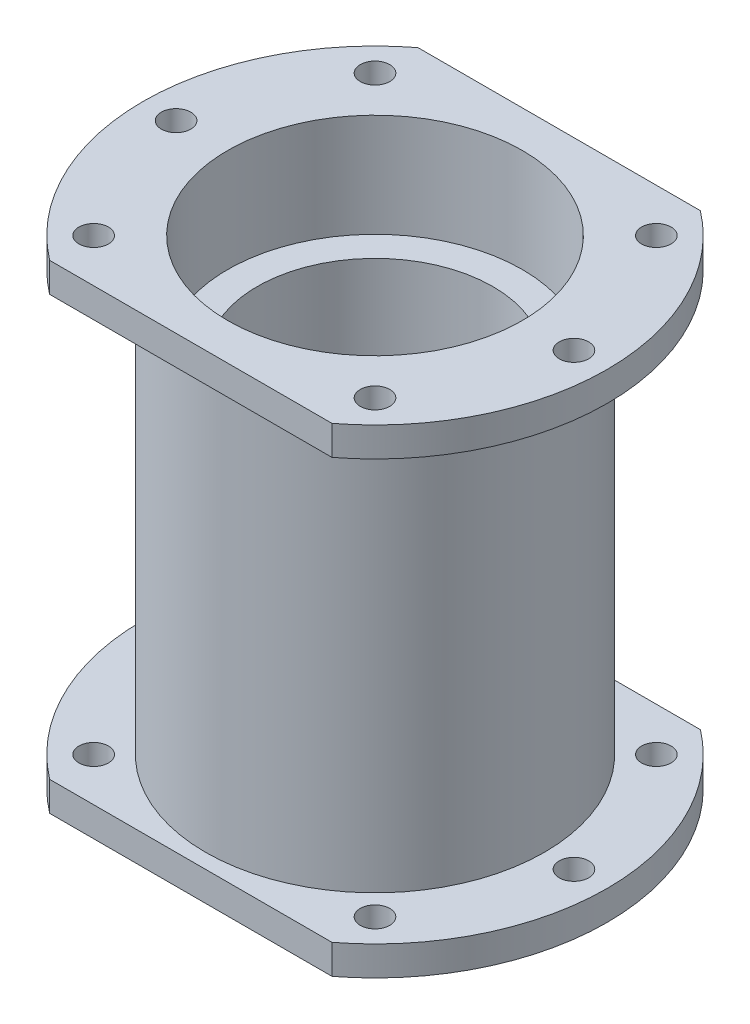
ISO-10303-21;
HEADER;
FILE_DESCRIPTION(('STEP AP214'),'2;1');
FILE_NAME('part.step','',(''),(''),'','','');
FILE_SCHEMA(('AUTOMOTIVE_DESIGN { 1 0 10303 214 1 1 1 1 }'));
ENDSEC;
DATA;
#1=APPLICATION_CONTEXT('core data for automotive mechanical design processes');
#2=APPLICATION_PROTOCOL_DEFINITION('international standard','automotive_design',2000,#1);
#3=PRODUCT_CONTEXT('',#1,'mechanical');
#4=PRODUCT('Part','Part','',(#3));
#5=PRODUCT_RELATED_PRODUCT_CATEGORY('part','',(#4));
#6=PRODUCT_DEFINITION_FORMATION('','',#4);
#7=PRODUCT_DEFINITION_CONTEXT('part definition',#1,'design');
#8=PRODUCT_DEFINITION('design','',#6,#7);
#9=PRODUCT_DEFINITION_SHAPE('','',#8);
#10=(LENGTH_UNIT() NAMED_UNIT(*) SI_UNIT(.MILLI.,.METRE.));
#11=(NAMED_UNIT(*) PLANE_ANGLE_UNIT() SI_UNIT($,.RADIAN.));
#12=(NAMED_UNIT(*) SI_UNIT($,.STERADIAN.) SOLID_ANGLE_UNIT());
#13=UNCERTAINTY_MEASURE_WITH_UNIT(LENGTH_MEASURE(1.E-05),#10,'distance_accuracy_value','');
#14=(GEOMETRIC_REPRESENTATION_CONTEXT(3) GLOBAL_UNCERTAINTY_ASSIGNED_CONTEXT((#13)) GLOBAL_UNIT_ASSIGNED_CONTEXT((#10,
#11,#12)) REPRESENTATION_CONTEXT('',''));
#15=CARTESIAN_POINT('',(0.,0.,0.));
#16=DIRECTION('',(0.,0.,1.));
#17=DIRECTION('',(1.,0.,0.));
#18=AXIS2_PLACEMENT_3D('',#15,#16,#17);
#19=CARTESIAN_POINT('',(0.,28.5,0.));
#20=DIRECTION('',(0.,1.,0.));
#21=DIRECTION('',(0.,0.,1.));
#22=AXIS2_PLACEMENT_3D('',#19,#20,#21);
#23=CYLINDRICAL_SURFACE('',#22,31.5);
#24=DIRECTION('',(0.,1.,0.));
#25=VECTOR('',#24,1.);
#26=CARTESIAN_POINT('',(19.1637678967368,28.5,-25.));
#27=LINE('',#26,#25);
#28=CARTESIAN_POINT('',(19.1637678967368,32.5,-25.));
#29=VERTEX_POINT('',#28);
#30=CARTESIAN_POINT('',(19.1637678967368,28.5,-25.));
#31=VERTEX_POINT('',#30);
#32=EDGE_CURVE('E243',#29,#31,#27,.F.);
#33=ORIENTED_EDGE('',*,*,#32,.F.);
#34=CARTESIAN_POINT('',(0.,32.5,0.));
#35=DIRECTION('',(0.,1.,0.));
#36=DIRECTION('',(0.,0.,1.));
#37=AXIS2_PLACEMENT_3D('',#34,#35,#36);
#38=CIRCLE('',#37,31.5);
#39=CARTESIAN_POINT('',(19.1637678967368,32.5,25.));
#40=VERTEX_POINT('',#39);
#41=EDGE_CURVE('E177',#40,#29,#38,.T.);
#42=ORIENTED_EDGE('',*,*,#41,.F.);
#43=DIRECTION('',(0.,1.,0.));
#44=VECTOR('',#43,1.);
#45=CARTESIAN_POINT('',(19.1637678967368,28.5,25.));
#46=LINE('',#45,#44);
#47=CARTESIAN_POINT('',(19.1637678967368,28.5,25.));
#48=VERTEX_POINT('',#47);
#49=EDGE_CURVE('E524',#48,#40,#46,.T.);
#50=ORIENTED_EDGE('',*,*,#49,.F.);
#51=CARTESIAN_POINT('',(0.,28.5,0.));
#52=DIRECTION('',(0.,1.,0.));
#53=DIRECTION('',(0.,0.,1.));
#54=AXIS2_PLACEMENT_3D('',#51,#52,#53);
#55=CIRCLE('',#54,31.5);
#56=EDGE_CURVE('E172',#48,#31,#55,.T.);
#57=ORIENTED_EDGE('',*,*,#56,.T.);
#58=EDGE_LOOP('',(#33,#42,#50,#57));
#59=FACE_BOUND('',#58,.T.);
#60=ADVANCED_FACE('F35',(#59),#23,.T.);
#61=CARTESIAN_POINT('',(0.,-28.5,0.));
#62=DIRECTION('',(0.,-1.,0.));
#63=DIRECTION('',(0.,0.,-1.));
#64=AXIS2_PLACEMENT_3D('',#61,#62,#63);
#65=CYLINDRICAL_SURFACE('',#64,31.5);
#66=CARTESIAN_POINT('',(0.,-28.5,0.));
#67=DIRECTION('',(0.,1.,0.));
#68=DIRECTION('',(0.,0.,1.));
#69=AXIS2_PLACEMENT_3D('',#66,#67,#68);
#70=CIRCLE('',#69,31.5);
#71=CARTESIAN_POINT('',(-19.1637678967368,-28.5,-25.));
#72=VERTEX_POINT('',#71);
#73=CARTESIAN_POINT('',(-19.1637678967368,-28.5,25.));
#74=VERTEX_POINT('',#73);
#75=EDGE_CURVE('E127',#72,#74,#70,.T.);
#76=ORIENTED_EDGE('',*,*,#75,.F.);
#77=DIRECTION('',(0.,-1.,0.));
#78=VECTOR('',#77,1.);
#79=CARTESIAN_POINT('',(-19.1637678967368,-28.5,-25.));
#80=LINE('',#79,#78);
#81=CARTESIAN_POINT('',(-19.1637678967368,-32.5,-25.));
#82=VERTEX_POINT('',#81);
#83=EDGE_CURVE('E527',#72,#82,#80,.T.);
#84=ORIENTED_EDGE('',*,*,#83,.T.);
#85=CARTESIAN_POINT('',(0.,-32.5,0.));
#86=DIRECTION('',(0.,1.,0.));
#87=DIRECTION('',(0.,0.,1.));
#88=AXIS2_PLACEMENT_3D('',#85,#86,#87);
#89=CIRCLE('',#88,31.5);
#90=CARTESIAN_POINT('',(-19.1637678967368,-32.5,25.));
#91=VERTEX_POINT('',#90);
#92=EDGE_CURVE('E128',#82,#91,#89,.T.);
#93=ORIENTED_EDGE('',*,*,#92,.T.);
#94=DIRECTION('',(0.,-1.,0.));
#95=VECTOR('',#94,1.);
#96=CARTESIAN_POINT('',(-19.1637678967368,-28.5,25.));
#97=LINE('',#96,#95);
#98=EDGE_CURVE('E107',#91,#74,#97,.F.);
#99=ORIENTED_EDGE('',*,*,#98,.T.);
#100=EDGE_LOOP('',(#76,#84,#93,#99));
#101=FACE_BOUND('',#100,.T.);
#102=ADVANCED_FACE('F294',(#101),#65,.T.);
#103=CARTESIAN_POINT('',(0.,75.0967815173013,0.));
#104=DIRECTION('',(0.,1.,0.));
#105=DIRECTION('',(0.,0.,1.));
#106=AXIS2_PLACEMENT_3D('',#103,#104,#105);
#107=CYLINDRICAL_SURFACE('',#106,23.);
#108=CARTESIAN_POINT('',(0.,28.5,0.));
#109=DIRECTION('',(0.,1.,0.));
#110=DIRECTION('',(0.,0.,1.));
#111=AXIS2_PLACEMENT_3D('',#108,#109,#110);
#112=CIRCLE('',#111,23.);
#113=CARTESIAN_POINT('',(0.,28.5,23.));
#114=VERTEX_POINT('',#113);
#115=EDGE_CURVE('E175',#114,#114,#112,.F.);
#116=ORIENTED_EDGE('',*,*,#115,.T.);
#117=EDGE_LOOP('',(#116));
#118=FACE_BOUND('',#117,.T.);
#119=CARTESIAN_POINT('',(0.,-28.5,0.));
#120=DIRECTION('',(0.,-1.,0.));
#121=DIRECTION('',(0.,0.,-1.));
#122=AXIS2_PLACEMENT_3D('',#119,#120,#121);
#123=CIRCLE('',#122,23.);
#124=CARTESIAN_POINT('',(0.,-28.5,-23.));
#125=VERTEX_POINT('',#124);
#126=EDGE_CURVE('E39',#125,#125,#123,.F.);
#127=ORIENTED_EDGE('',*,*,#126,.T.);
#128=EDGE_LOOP('',(#127));
#129=FACE_BOUND('',#128,.T.);
#130=ADVANCED_FACE('F208',(#118,#129),#107,.T.);
#131=CARTESIAN_POINT('',(-12.,-2.5,0.));
#132=DIRECTION('',(0.,-1.,0.));
#133=DIRECTION('',(0.,0.,-1.));
#134=AXIS2_PLACEMENT_3D('',#131,#132,#133);
#135=PLANE('',#134);
#136=CARTESIAN_POINT('',(0.,-2.5,0.));
#137=DIRECTION('',(0.,1.,0.));
#138=DIRECTION('',(0.,0.,1.));
#139=AXIS2_PLACEMENT_3D('',#136,#137,#138);
#140=CIRCLE('',#139,12.);
#141=CARTESIAN_POINT('',(0.,-2.5,12.));
#142=VERTEX_POINT('',#141);
#143=EDGE_CURVE('E11',#142,#142,#140,.T.);
#144=ORIENTED_EDGE('',*,*,#143,.T.);
#145=EDGE_LOOP('',(#144));
#146=FACE_BOUND('',#145,.T.);
#147=CARTESIAN_POINT('',(0.,-2.5,0.));
#148=DIRECTION('',(0.,1.,0.));
#149=DIRECTION('',(0.,0.,1.));
#150=AXIS2_PLACEMENT_3D('',#147,#148,#149);
#151=CIRCLE('',#150,16.);
#152=CARTESIAN_POINT('',(0.,-2.5,16.));
#153=VERTEX_POINT('',#152);
#154=EDGE_CURVE('E180',#153,#153,#151,.T.);
#155=ORIENTED_EDGE('',*,*,#154,.F.);
#156=EDGE_LOOP('',(#155));
#157=FACE_BOUND('',#156,.T.);
#158=ADVANCED_FACE('F37',(#146,#157),#135,.T.);
#159=CARTESIAN_POINT('',(0.,75.0967815173013,0.));
#160=DIRECTION('',(0.,1.,0.));
#161=DIRECTION('',(0.,0.,1.));
#162=AXIS2_PLACEMENT_3D('',#159,#160,#161);
#163=CYLINDRICAL_SURFACE('',#162,12.);
#164=CARTESIAN_POINT('',(0.,2.5,0.));
#165=DIRECTION('',(0.,1.,0.));
#166=DIRECTION('',(0.,0.,1.));
#167=AXIS2_PLACEMENT_3D('',#164,#165,#166);
#168=CIRCLE('',#167,12.);
#169=CARTESIAN_POINT('',(0.,2.5,12.));
#170=VERTEX_POINT('',#169);
#171=EDGE_CURVE('E44',#170,#170,#168,.T.);
#172=ORIENTED_EDGE('',*,*,#171,.T.);
#173=EDGE_LOOP('',(#172));
#174=FACE_BOUND('',#173,.T.);
#175=ORIENTED_EDGE('',*,*,#143,.F.);
#176=EDGE_LOOP('',(#175));
#177=FACE_BOUND('',#176,.T.);
#178=ADVANCED_FACE('F345',(#174,#177),#163,.F.);
#179=CARTESIAN_POINT('',(-12.,2.5,0.));
#180=DIRECTION('',(0.,1.,0.));
#181=DIRECTION('',(0.,0.,1.));
#182=AXIS2_PLACEMENT_3D('',#179,#180,#181);
#183=PLANE('',#182);
#184=CARTESIAN_POINT('',(0.,2.5,0.));
#185=DIRECTION('',(0.,1.,0.));
#186=DIRECTION('',(0.,0.,1.));
#187=AXIS2_PLACEMENT_3D('',#184,#185,#186);
#188=CIRCLE('',#187,16.);
#189=CARTESIAN_POINT('',(0.,2.5,16.));
#190=VERTEX_POINT('',#189);
#191=EDGE_CURVE('E201',#190,#190,#188,.T.);
#192=ORIENTED_EDGE('',*,*,#191,.T.);
#193=EDGE_LOOP('',(#192));
#194=FACE_BOUND('',#193,.T.);
#195=ORIENTED_EDGE('',*,*,#171,.F.);
#196=EDGE_LOOP('',(#195));
#197=FACE_BOUND('',#196,.T.);
#198=ADVANCED_FACE('F342',(#194,#197),#183,.T.);
#199=CARTESIAN_POINT('',(0.,75.0967815173013,0.));
#200=DIRECTION('',(0.,1.,0.));
#201=DIRECTION('',(0.,0.,1.));
#202=AXIS2_PLACEMENT_3D('',#199,#200,#201);
#203=CYLINDRICAL_SURFACE('',#202,16.);
#204=CARTESIAN_POINT('',(0.,18.5,0.));
#205=DIRECTION('',(0.,1.,0.));
#206=DIRECTION('',(0.,0.,1.));
#207=AXIS2_PLACEMENT_3D('',#204,#205,#206);
#208=CIRCLE('',#207,16.);
#209=CARTESIAN_POINT('',(0.,18.5,16.));
#210=VERTEX_POINT('',#209);
#211=EDGE_CURVE('E198',#210,#210,#208,.T.);
#212=ORIENTED_EDGE('',*,*,#211,.T.);
#213=EDGE_LOOP('',(#212));
#214=FACE_BOUND('',#213,.T.);
#215=ORIENTED_EDGE('',*,*,#191,.F.);
#216=EDGE_LOOP('',(#215));
#217=FACE_BOUND('',#216,.T.);
#218=ADVANCED_FACE('F338',(#214,#217),#203,.F.);
#219=CARTESIAN_POINT('',(-16.,18.5,0.));
#220=DIRECTION('',(0.,1.,0.));
#221=DIRECTION('',(0.,0.,1.));
#222=AXIS2_PLACEMENT_3D('',#219,#220,#221);
#223=PLANE('',#222);
#224=CARTESIAN_POINT('',(0.,18.5,0.));
#225=DIRECTION('',(0.,1.,0.));
#226=DIRECTION('',(0.,0.,1.));
#227=AXIS2_PLACEMENT_3D('',#224,#225,#226);
#228=CIRCLE('',#227,20.);
#229=CARTESIAN_POINT('',(0.,18.5,20.));
#230=VERTEX_POINT('',#229);
#231=EDGE_CURVE('E195',#230,#230,#228,.T.);
#232=ORIENTED_EDGE('',*,*,#231,.T.);
#233=EDGE_LOOP('',(#232));
#234=FACE_BOUND('',#233,.T.);
#235=ORIENTED_EDGE('',*,*,#211,.F.);
#236=EDGE_LOOP('',(#235));
#237=FACE_BOUND('',#236,.T.);
#238=ADVANCED_FACE('F334',(#234,#237),#223,.T.);
#239=CARTESIAN_POINT('',(0.,75.0967815173013,0.));
#240=DIRECTION('',(0.,1.,0.));
#241=DIRECTION('',(0.,0.,1.));
#242=AXIS2_PLACEMENT_3D('',#239,#240,#241);
#243=CYLINDRICAL_SURFACE('',#242,20.);
#244=CARTESIAN_POINT('',(0.,32.5,0.));
#245=DIRECTION('',(0.,1.,0.));
#246=DIRECTION('',(0.,0.,1.));
#247=AXIS2_PLACEMENT_3D('',#244,#245,#246);
#248=CIRCLE('',#247,20.);
#249=CARTESIAN_POINT('',(0.,32.5,20.));
#250=VERTEX_POINT('',#249);
#251=EDGE_CURVE('E192',#250,#250,#248,.T.);
#252=ORIENTED_EDGE('',*,*,#251,.T.);
#253=EDGE_LOOP('',(#252));
#254=FACE_BOUND('',#253,.T.);
#255=ORIENTED_EDGE('',*,*,#231,.F.);
#256=EDGE_LOOP('',(#255));
#257=FACE_BOUND('',#256,.T.);
#258=ADVANCED_FACE('F330',(#254,#257),#243,.F.);
#259=CARTESIAN_POINT('',(-23.,32.5,0.));
#260=DIRECTION('',(0.,1.,0.));
#261=DIRECTION('',(0.,0.,1.));
#262=AXIS2_PLACEMENT_3D('',#259,#260,#261);
#263=PLANE('',#262);
#264=DIRECTION('',(1.,0.,0.));
#265=VECTOR('',#264,1.);
#266=CARTESIAN_POINT('',(-43.9507755665767,32.5,-25.));
#267=LINE('',#266,#265);
#268=CARTESIAN_POINT('',(-19.1637678967368,32.5,-25.));
#269=VERTEX_POINT('',#268);
#270=EDGE_CURVE('E112',#269,#29,#267,.T.);
#271=ORIENTED_EDGE('',*,*,#270,.F.);
#272=CARTESIAN_POINT('',(-19.1637678967368,32.5,25.));
#273=VERTEX_POINT('',#272);
#274=EDGE_CURVE('E169',#269,#273,#38,.T.);
#275=ORIENTED_EDGE('',*,*,#274,.T.);
#276=DIRECTION('',(-1.,0.,0.));
#277=VECTOR('',#276,1.);
#278=CARTESIAN_POINT('',(-43.9507755665767,32.5,25.));
#279=LINE('',#278,#277);
#280=EDGE_CURVE('E113',#40,#273,#279,.T.);
#281=ORIENTED_EDGE('',*,*,#280,.F.);
#282=ORIENTED_EDGE('',*,*,#41,.T.);
#283=EDGE_LOOP('',(#271,#275,#281,#282));
#284=FACE_BOUND('',#283,.T.);
#285=CARTESIAN_POINT('',(-19.0918830920368,32.5,-19.0918830920368));
#286=DIRECTION('',(0.,1.,0.));
#287=DIRECTION('',(0.,0.,1.));
#288=AXIS2_PLACEMENT_3D('',#285,#286,#287);
#289=CIRCLE('',#288,2.00000000000001);
#290=CARTESIAN_POINT('',(-19.0918830920368,32.5,-17.0918830920368));
#291=VERTEX_POINT('',#290);
#292=EDGE_CURVE('E139',#291,#291,#289,.T.);
#293=ORIENTED_EDGE('',*,*,#292,.F.);
#294=EDGE_LOOP('',(#293));
#295=FACE_BOUND('',#294,.T.);
#296=CARTESIAN_POINT('',(-27.,32.5,0.));
#297=DIRECTION('',(0.,1.,0.));
#298=DIRECTION('',(0.,0.,1.));
#299=AXIS2_PLACEMENT_3D('',#296,#297,#298);
#300=CIRCLE('',#299,2.);
#301=CARTESIAN_POINT('',(-27.,32.5,2.));
#302=VERTEX_POINT('',#301);
#303=EDGE_CURVE('E138',#302,#302,#300,.T.);
#304=ORIENTED_EDGE('',*,*,#303,.F.);
#305=EDGE_LOOP('',(#304));
#306=FACE_BOUND('',#305,.T.);
#307=CARTESIAN_POINT('',(-19.0918830920368,32.5,19.0918830920368));
#308=DIRECTION('',(0.,1.,0.));
#309=DIRECTION('',(0.,0.,1.));
#310=AXIS2_PLACEMENT_3D('',#307,#308,#309);
#311=CIRCLE('',#310,2.00000000000001);
#312=CARTESIAN_POINT('',(-19.0918830920368,32.5,21.0918830920368));
#313=VERTEX_POINT('',#312);
#314=EDGE_CURVE('E145',#313,#313,#311,.T.);
#315=ORIENTED_EDGE('',*,*,#314,.F.);
#316=EDGE_LOOP('',(#315));
#317=FACE_BOUND('',#316,.T.);
#318=CARTESIAN_POINT('',(19.0918830920368,32.5,19.0918830920368));
#319=DIRECTION('',(0.,1.,0.));
#320=DIRECTION('',(0.,0.,1.));
#321=AXIS2_PLACEMENT_3D('',#318,#319,#320);
#322=CIRCLE('',#321,2.00000000000001);
#323=CARTESIAN_POINT('',(19.0918830920368,32.5,21.0918830920368));
#324=VERTEX_POINT('',#323);
#325=EDGE_CURVE('E151',#324,#324,#322,.T.);
#326=ORIENTED_EDGE('',*,*,#325,.F.);
#327=EDGE_LOOP('',(#326));
#328=FACE_BOUND('',#327,.T.);
#329=CARTESIAN_POINT('',(27.,32.5,0.));
#330=DIRECTION('',(0.,1.,0.));
#331=DIRECTION('',(0.,0.,1.));
#332=AXIS2_PLACEMENT_3D('',#329,#330,#331);
#333=CIRCLE('',#332,2.);
#334=CARTESIAN_POINT('',(27.,32.5,2.));
#335=VERTEX_POINT('',#334);
#336=EDGE_CURVE('E157',#335,#335,#333,.T.);
#337=ORIENTED_EDGE('',*,*,#336,.F.);
#338=EDGE_LOOP('',(#337));
#339=FACE_BOUND('',#338,.T.);
#340=CARTESIAN_POINT('',(19.0918830920368,32.5,-19.0918830920368));
#341=DIRECTION('',(0.,1.,0.));
#342=DIRECTION('',(0.,0.,1.));
#343=AXIS2_PLACEMENT_3D('',#340,#341,#342);
#344=CIRCLE('',#343,2.00000000000001);
#345=CARTESIAN_POINT('',(19.0918830920368,32.5,-17.0918830920368));
#346=VERTEX_POINT('',#345);
#347=EDGE_CURVE('E163',#346,#346,#344,.T.);
#348=ORIENTED_EDGE('',*,*,#347,.F.);
#349=EDGE_LOOP('',(#348));
#350=FACE_BOUND('',#349,.T.);
#351=ORIENTED_EDGE('',*,*,#251,.F.);
#352=EDGE_LOOP('',(#351));
#353=FACE_BOUND('',#352,.T.);
#354=ADVANCED_FACE('F325',(#284,#295,#306,#317,#328,#339,#350,#353),#263,.T.);
#355=CARTESIAN_POINT('',(-23.,-32.5,0.));
#356=DIRECTION('',(0.,-1.,0.));
#357=DIRECTION('',(0.,0.,-1.));
#358=AXIS2_PLACEMENT_3D('',#355,#356,#357);
#359=PLANE('',#358);
#360=DIRECTION('',(1.,0.,0.));
#361=VECTOR('',#360,1.);
#362=CARTESIAN_POINT('',(-43.9507755665767,-32.5,-25.));
#363=LINE('',#362,#361);
#364=CARTESIAN_POINT('',(19.1637678967368,-32.5,-25.));
#365=VERTEX_POINT('',#364);
#366=EDGE_CURVE('E122',#82,#365,#363,.T.);
#367=ORIENTED_EDGE('',*,*,#366,.T.);
#368=CARTESIAN_POINT('',(19.1637678967368,-32.5,25.));
#369=VERTEX_POINT('',#368);
#370=EDGE_CURVE('E119',#369,#365,#89,.T.);
#371=ORIENTED_EDGE('',*,*,#370,.F.);
#372=DIRECTION('',(-1.,0.,0.));
#373=VECTOR('',#372,1.);
#374=CARTESIAN_POINT('',(-43.9507755665767,-32.5,25.));
#375=LINE('',#374,#373);
#376=EDGE_CURVE('E101',#369,#91,#375,.T.);
#377=ORIENTED_EDGE('',*,*,#376,.T.);
#378=ORIENTED_EDGE('',*,*,#92,.F.);
#379=EDGE_LOOP('',(#367,#371,#377,#378));
#380=FACE_BOUND('',#379,.T.);
#381=CARTESIAN_POINT('',(0.,-32.5,0.));
#382=DIRECTION('',(0.,1.,0.));
#383=DIRECTION('',(0.,0.,1.));
#384=AXIS2_PLACEMENT_3D('',#381,#382,#383);
#385=CIRCLE('',#384,20.);
#386=CARTESIAN_POINT('',(0.,-32.5,20.));
#387=VERTEX_POINT('',#386);
#388=EDGE_CURVE('E189',#387,#387,#385,.T.);
#389=ORIENTED_EDGE('',*,*,#388,.T.);
#390=EDGE_LOOP('',(#389));
#391=FACE_BOUND('',#390,.T.);
#392=CARTESIAN_POINT('',(-27.,-32.5,0.));
#393=DIRECTION('',(0.,1.,0.));
#394=DIRECTION('',(0.,0.,1.));
#395=AXIS2_PLACEMENT_3D('',#392,#393,#394);
#396=CIRCLE('',#395,2.);
#397=CARTESIAN_POINT('',(-27.,-32.5,2.));
#398=VERTEX_POINT('',#397);
#399=EDGE_CURVE('E248',#398,#398,#396,.T.);
#400=ORIENTED_EDGE('',*,*,#399,.T.);
#401=EDGE_LOOP('',(#400));
#402=FACE_BOUND('',#401,.T.);
#403=CARTESIAN_POINT('',(19.0918830920368,-32.5,19.0918830920368));
#404=DIRECTION('',(0.,1.,0.));
#405=DIRECTION('',(0.,0.,1.));
#406=AXIS2_PLACEMENT_3D('',#403,#404,#405);
#407=CIRCLE('',#406,2.00000000000001);
#408=CARTESIAN_POINT('',(19.0918830920368,-32.5,21.0918830920368));
#409=VERTEX_POINT('',#408);
#410=EDGE_CURVE('E259',#409,#409,#407,.T.);
#411=ORIENTED_EDGE('',*,*,#410,.T.);
#412=EDGE_LOOP('',(#411));
#413=FACE_BOUND('',#412,.T.);
#414=CARTESIAN_POINT('',(19.0918830920368,-32.5,-19.0918830920368));
#415=DIRECTION('',(0.,1.,0.));
#416=DIRECTION('',(0.,0.,1.));
#417=AXIS2_PLACEMENT_3D('',#414,#415,#416);
#418=CIRCLE('',#417,2.00000000000001);
#419=CARTESIAN_POINT('',(19.0918830920368,-32.5,-17.0918830920368));
#420=VERTEX_POINT('',#419);
#421=EDGE_CURVE('E271',#420,#420,#418,.T.);
#422=ORIENTED_EDGE('',*,*,#421,.T.);
#423=EDGE_LOOP('',(#422));
#424=FACE_BOUND('',#423,.T.);
#425=CARTESIAN_POINT('',(27.,-32.5,0.));
#426=DIRECTION('',(0.,1.,0.));
#427=DIRECTION('',(0.,0.,1.));
#428=AXIS2_PLACEMENT_3D('',#425,#426,#427);
#429=CIRCLE('',#428,2.);
#430=CARTESIAN_POINT('',(27.,-32.5,2.));
#431=VERTEX_POINT('',#430);
#432=EDGE_CURVE('E265',#431,#431,#429,.T.);
#433=ORIENTED_EDGE('',*,*,#432,.T.);
#434=EDGE_LOOP('',(#433));
#435=FACE_BOUND('',#434,.T.);
#436=CARTESIAN_POINT('',(-19.0918830920368,-32.5,19.0918830920368));
#437=DIRECTION('',(0.,1.,0.));
#438=DIRECTION('',(0.,0.,1.));
#439=AXIS2_PLACEMENT_3D('',#436,#437,#438);
#440=CIRCLE('',#439,2.00000000000001);
#441=CARTESIAN_POINT('',(-19.0918830920368,-32.5,21.0918830920368));
#442=VERTEX_POINT('',#441);
#443=EDGE_CURVE('E253',#442,#442,#440,.T.);
#444=ORIENTED_EDGE('',*,*,#443,.T.);
#445=EDGE_LOOP('',(#444));
#446=FACE_BOUND('',#445,.T.);
#447=CARTESIAN_POINT('',(-19.0918830920368,-32.5,-19.0918830920368));
#448=DIRECTION('',(0.,1.,0.));
#449=DIRECTION('',(0.,0.,1.));
#450=AXIS2_PLACEMENT_3D('',#447,#448,#449);
#451=CIRCLE('',#450,2.00000000000001);
#452=CARTESIAN_POINT('',(-19.0918830920368,-32.5,-17.0918830920368));
#453=VERTEX_POINT('',#452);
#454=EDGE_CURVE('E238',#453,#453,#451,.T.);
#455=ORIENTED_EDGE('',*,*,#454,.T.);
#456=EDGE_LOOP('',(#455));
#457=FACE_BOUND('',#456,.T.);
#458=ADVANCED_FACE('F125',(#380,#391,#402,#413,#424,#435,#446,#457),#359,.T.);
#459=CARTESIAN_POINT('',(0.,75.0967815173013,0.));
#460=DIRECTION('',(0.,1.,0.));
#461=DIRECTION('',(0.,0.,1.));
#462=AXIS2_PLACEMENT_3D('',#459,#460,#461);
#463=CYLINDRICAL_SURFACE('',#462,20.);
#464=CARTESIAN_POINT('',(0.,-18.5,0.));
#465=DIRECTION('',(0.,1.,0.));
#466=DIRECTION('',(0.,0.,1.));
#467=AXIS2_PLACEMENT_3D('',#464,#465,#466);
#468=CIRCLE('',#467,20.);
#469=CARTESIAN_POINT('',(0.,-18.5,20.));
#470=VERTEX_POINT('',#469);
#471=EDGE_CURVE('E186',#470,#470,#468,.T.);
#472=ORIENTED_EDGE('',*,*,#471,.T.);
#473=EDGE_LOOP('',(#472));
#474=FACE_BOUND('',#473,.T.);
#475=ORIENTED_EDGE('',*,*,#388,.F.);
#476=EDGE_LOOP('',(#475));
#477=FACE_BOUND('',#476,.T.);
#478=ADVANCED_FACE('F315',(#474,#477),#463,.F.);
#479=CARTESIAN_POINT('',(-16.,-18.5,0.));
#480=DIRECTION('',(0.,-1.,0.));
#481=DIRECTION('',(0.,0.,-1.));
#482=AXIS2_PLACEMENT_3D('',#479,#480,#481);
#483=PLANE('',#482);
#484=CARTESIAN_POINT('',(0.,-18.5,0.));
#485=DIRECTION('',(0.,1.,0.));
#486=DIRECTION('',(0.,0.,1.));
#487=AXIS2_PLACEMENT_3D('',#484,#485,#486);
#488=CIRCLE('',#487,16.);
#489=CARTESIAN_POINT('',(0.,-18.5,16.));
#490=VERTEX_POINT('',#489);
#491=EDGE_CURVE('E183',#490,#490,#488,.T.);
#492=ORIENTED_EDGE('',*,*,#491,.T.);
#493=EDGE_LOOP('',(#492));
#494=FACE_BOUND('',#493,.T.);
#495=ORIENTED_EDGE('',*,*,#471,.F.);
#496=EDGE_LOOP('',(#495));
#497=FACE_BOUND('',#496,.T.);
#498=ADVANCED_FACE('F310',(#494,#497),#483,.T.);
#499=CARTESIAN_POINT('',(0.,75.0967815173013,0.));
#500=DIRECTION('',(0.,1.,0.));
#501=DIRECTION('',(0.,0.,1.));
#502=AXIS2_PLACEMENT_3D('',#499,#500,#501);
#503=CYLINDRICAL_SURFACE('',#502,16.);
#504=ORIENTED_EDGE('',*,*,#154,.T.);
#505=EDGE_LOOP('',(#504));
#506=FACE_BOUND('',#505,.T.);
#507=ORIENTED_EDGE('',*,*,#491,.F.);
#508=EDGE_LOOP('',(#507));
#509=FACE_BOUND('',#508,.T.);
#510=ADVANCED_FACE('F306',(#506,#509),#503,.F.);
#511=DIRECTION('',(0.,1.,0.));
#512=VECTOR('',#511,1.);
#513=CARTESIAN_POINT('',(-19.1637678967368,28.5,-25.));
#514=LINE('',#513,#512);
#515=CARTESIAN_POINT('',(-19.1637678967368,28.5,-25.));
#516=VERTEX_POINT('',#515);
#517=EDGE_CURVE('E236',#516,#269,#514,.T.);
#518=ORIENTED_EDGE('',*,*,#517,.F.);
#519=CARTESIAN_POINT('',(-19.1637678967368,28.5,25.));
#520=VERTEX_POINT('',#519);
#521=EDGE_CURVE('E176',#516,#520,#55,.T.);
#522=ORIENTED_EDGE('',*,*,#521,.T.);
#523=DIRECTION('',(0.,1.,0.));
#524=VECTOR('',#523,1.);
#525=CARTESIAN_POINT('',(-19.1637678967368,28.5,25.));
#526=LINE('',#525,#524);
#527=EDGE_CURVE('E233',#273,#520,#526,.F.);
#528=ORIENTED_EDGE('',*,*,#527,.F.);
#529=ORIENTED_EDGE('',*,*,#274,.F.);
#530=EDGE_LOOP('',(#518,#522,#528,#529));
#531=FACE_BOUND('',#530,.T.);
#532=ADVANCED_FACE('F215',(#531),#23,.T.);
#533=CARTESIAN_POINT('',(0.,28.5,0.));
#534=DIRECTION('',(0.,1.,0.));
#535=DIRECTION('',(0.,0.,1.));
#536=AXIS2_PLACEMENT_3D('',#533,#534,#535);
#537=PLANE('',#536);
#538=ORIENTED_EDGE('',*,*,#115,.F.);
#539=EDGE_LOOP('',(#538));
#540=FACE_BOUND('',#539,.T.);
#541=CARTESIAN_POINT('',(-19.0918830920368,28.5,-19.0918830920368));
#542=DIRECTION('',(0.,1.,0.));
#543=DIRECTION('',(0.,0.,1.));
#544=AXIS2_PLACEMENT_3D('',#541,#542,#543);
#545=CIRCLE('',#544,2.00000000000001);
#546=CARTESIAN_POINT('',(-19.0918830920368,28.5,-17.0918830920368));
#547=VERTEX_POINT('',#546);
#548=EDGE_CURVE('E135',#547,#547,#545,.T.);
#549=ORIENTED_EDGE('',*,*,#548,.T.);
#550=EDGE_LOOP('',(#549));
#551=FACE_BOUND('',#550,.T.);
#552=CARTESIAN_POINT('',(-27.,28.5,0.));
#553=DIRECTION('',(0.,1.,0.));
#554=DIRECTION('',(0.,0.,1.));
#555=AXIS2_PLACEMENT_3D('',#552,#553,#554);
#556=CIRCLE('',#555,2.);
#557=CARTESIAN_POINT('',(-27.,28.5,2.));
#558=VERTEX_POINT('',#557);
#559=EDGE_CURVE('E142',#558,#558,#556,.T.);
#560=ORIENTED_EDGE('',*,*,#559,.T.);
#561=EDGE_LOOP('',(#560));
#562=FACE_BOUND('',#561,.T.);
#563=CARTESIAN_POINT('',(-19.0918830920368,28.5,19.0918830920368));
#564=DIRECTION('',(0.,1.,0.));
#565=DIRECTION('',(0.,0.,1.));
#566=AXIS2_PLACEMENT_3D('',#563,#564,#565);
#567=CIRCLE('',#566,2.00000000000001);
#568=CARTESIAN_POINT('',(-19.0918830920368,28.5,21.0918830920368));
#569=VERTEX_POINT('',#568);
#570=EDGE_CURVE('E148',#569,#569,#567,.T.);
#571=ORIENTED_EDGE('',*,*,#570,.T.);
#572=EDGE_LOOP('',(#571));
#573=FACE_BOUND('',#572,.T.);
#574=CARTESIAN_POINT('',(19.0918830920368,28.5,19.0918830920368));
#575=DIRECTION('',(0.,1.,0.));
#576=DIRECTION('',(0.,0.,1.));
#577=AXIS2_PLACEMENT_3D('',#574,#575,#576);
#578=CIRCLE('',#577,2.00000000000001);
#579=CARTESIAN_POINT('',(19.0918830920368,28.5,21.0918830920368));
#580=VERTEX_POINT('',#579);
#581=EDGE_CURVE('E154',#580,#580,#578,.T.);
#582=ORIENTED_EDGE('',*,*,#581,.T.);
#583=EDGE_LOOP('',(#582));
#584=FACE_BOUND('',#583,.T.);
#585=CARTESIAN_POINT('',(27.,28.5,0.));
#586=DIRECTION('',(0.,1.,0.));
#587=DIRECTION('',(0.,0.,1.));
#588=AXIS2_PLACEMENT_3D('',#585,#586,#587);
#589=CIRCLE('',#588,2.);
#590=CARTESIAN_POINT('',(27.,28.5,2.));
#591=VERTEX_POINT('',#590);
#592=EDGE_CURVE('E160',#591,#591,#589,.T.);
#593=ORIENTED_EDGE('',*,*,#592,.T.);
#594=EDGE_LOOP('',(#593));
#595=FACE_BOUND('',#594,.T.);
#596=CARTESIAN_POINT('',(19.0918830920368,28.5,-19.0918830920368));
#597=DIRECTION('',(0.,1.,0.));
#598=DIRECTION('',(0.,0.,1.));
#599=AXIS2_PLACEMENT_3D('',#596,#597,#598);
#600=CIRCLE('',#599,2.00000000000001);
#601=CARTESIAN_POINT('',(19.0918830920368,28.5,-17.0918830920368));
#602=VERTEX_POINT('',#601);
#603=EDGE_CURVE('E166',#602,#602,#600,.T.);
#604=ORIENTED_EDGE('',*,*,#603,.T.);
#605=EDGE_LOOP('',(#604));
#606=FACE_BOUND('',#605,.T.);
#607=ORIENTED_EDGE('',*,*,#521,.F.);
#608=DIRECTION('',(1.,0.,0.));
#609=VECTOR('',#608,1.);
#610=CARTESIAN_POINT('',(0.,28.5,-25.));
#611=LINE('',#610,#609);
#612=EDGE_CURVE('E57',#516,#31,#611,.T.);
#613=ORIENTED_EDGE('',*,*,#612,.T.);
#614=ORIENTED_EDGE('',*,*,#56,.F.);
#615=DIRECTION('',(-1.,0.,0.));
#616=VECTOR('',#615,1.);
#617=CARTESIAN_POINT('',(0.,28.5,25.));
#618=LINE('',#617,#616);
#619=EDGE_CURVE('E52',#48,#520,#618,.T.);
#620=ORIENTED_EDGE('',*,*,#619,.T.);
#621=EDGE_LOOP('',(#607,#613,#614,#620));
#622=FACE_BOUND('',#621,.T.);
#623=ADVANCED_FACE('F211',(#540,#551,#562,#573,#584,#595,#606,#622),#537,.F.);
#624=CARTESIAN_POINT('',(19.0918830920368,28.5,-19.0918830920368));
#625=DIRECTION('',(0.,1.,0.));
#626=DIRECTION('',(0.,0.,1.));
#627=AXIS2_PLACEMENT_3D('',#624,#625,#626);
#628=CYLINDRICAL_SURFACE('',#627,2.00000000000001);
#629=ORIENTED_EDGE('',*,*,#603,.F.);
#630=EDGE_LOOP('',(#629));
#631=FACE_BOUND('',#630,.T.);
#632=ORIENTED_EDGE('',*,*,#347,.T.);
#633=EDGE_LOOP('',(#632));
#634=FACE_BOUND('',#633,.T.);
#635=ADVANCED_FACE('F214',(#631,#634),#628,.F.);
#636=CARTESIAN_POINT('',(27.,28.5,0.));
#637=DIRECTION('',(0.,1.,0.));
#638=DIRECTION('',(0.,0.,1.));
#639=AXIS2_PLACEMENT_3D('',#636,#637,#638);
#640=CYLINDRICAL_SURFACE('',#639,2.);
#641=ORIENTED_EDGE('',*,*,#592,.F.);
#642=EDGE_LOOP('',(#641));
#643=FACE_BOUND('',#642,.T.);
#644=ORIENTED_EDGE('',*,*,#336,.T.);
#645=EDGE_LOOP('',(#644));
#646=FACE_BOUND('',#645,.T.);
#647=ADVANCED_FACE('F575',(#643,#646),#640,.F.);
#648=CARTESIAN_POINT('',(19.0918830920368,28.5,19.0918830920368));
#649=DIRECTION('',(0.,1.,0.));
#650=DIRECTION('',(0.,0.,1.));
#651=AXIS2_PLACEMENT_3D('',#648,#649,#650);
#652=CYLINDRICAL_SURFACE('',#651,2.00000000000001);
#653=ORIENTED_EDGE('',*,*,#581,.F.);
#654=EDGE_LOOP('',(#653));
#655=FACE_BOUND('',#654,.T.);
#656=ORIENTED_EDGE('',*,*,#325,.T.);
#657=EDGE_LOOP('',(#656));
#658=FACE_BOUND('',#657,.T.);
#659=ADVANCED_FACE('F581',(#655,#658),#652,.F.);
#660=CARTESIAN_POINT('',(-19.0918830920368,28.5,19.0918830920368));
#661=DIRECTION('',(0.,1.,0.));
#662=DIRECTION('',(0.,0.,1.));
#663=AXIS2_PLACEMENT_3D('',#660,#661,#662);
#664=CYLINDRICAL_SURFACE('',#663,2.00000000000001);
#665=ORIENTED_EDGE('',*,*,#570,.F.);
#666=EDGE_LOOP('',(#665));
#667=FACE_BOUND('',#666,.T.);
#668=ORIENTED_EDGE('',*,*,#314,.T.);
#669=EDGE_LOOP('',(#668));
#670=FACE_BOUND('',#669,.T.);
#671=ADVANCED_FACE('F587',(#667,#670),#664,.F.);
#672=CARTESIAN_POINT('',(-27.,28.5,0.));
#673=DIRECTION('',(0.,1.,0.));
#674=DIRECTION('',(0.,0.,1.));
#675=AXIS2_PLACEMENT_3D('',#672,#673,#674);
#676=CYLINDRICAL_SURFACE('',#675,2.);
#677=ORIENTED_EDGE('',*,*,#559,.F.);
#678=EDGE_LOOP('',(#677));
#679=FACE_BOUND('',#678,.T.);
#680=ORIENTED_EDGE('',*,*,#303,.T.);
#681=EDGE_LOOP('',(#680));
#682=FACE_BOUND('',#681,.T.);
#683=ADVANCED_FACE('F591',(#679,#682),#676,.F.);
#684=CARTESIAN_POINT('',(-19.0918830920368,28.5,-19.0918830920368));
#685=DIRECTION('',(0.,1.,0.));
#686=DIRECTION('',(0.,0.,1.));
#687=AXIS2_PLACEMENT_3D('',#684,#685,#686);
#688=CYLINDRICAL_SURFACE('',#687,2.00000000000001);
#689=ORIENTED_EDGE('',*,*,#548,.F.);
#690=EDGE_LOOP('',(#689));
#691=FACE_BOUND('',#690,.T.);
#692=ORIENTED_EDGE('',*,*,#292,.T.);
#693=EDGE_LOOP('',(#692));
#694=FACE_BOUND('',#693,.T.);
#695=ADVANCED_FACE('F410',(#691,#694),#688,.F.);
#696=CARTESIAN_POINT('',(0.,-28.5,0.));
#697=DIRECTION('',(0.,-1.,0.));
#698=DIRECTION('',(0.,0.,1.));
#699=AXIS2_PLACEMENT_3D('',#696,#697,#698);
#700=PLANE('',#699);
#701=ORIENTED_EDGE('',*,*,#126,.F.);
#702=EDGE_LOOP('',(#701));
#703=FACE_BOUND('',#702,.T.);
#704=CARTESIAN_POINT('',(19.1637678967368,-28.5,25.));
#705=VERTEX_POINT('',#704);
#706=CARTESIAN_POINT('',(19.1637678967368,-28.5,-25.));
#707=VERTEX_POINT('',#706);
#708=EDGE_CURVE('E121',#705,#707,#70,.T.);
#709=ORIENTED_EDGE('',*,*,#708,.T.);
#710=DIRECTION('',(-1.,0.,0.));
#711=VECTOR('',#710,1.);
#712=CARTESIAN_POINT('',(0.,-28.5,-25.));
#713=LINE('',#712,#711);
#714=EDGE_CURVE('E531',#707,#72,#713,.T.);
#715=ORIENTED_EDGE('',*,*,#714,.T.);
#716=ORIENTED_EDGE('',*,*,#75,.T.);
#717=DIRECTION('',(1.,0.,0.));
#718=VECTOR('',#717,1.);
#719=CARTESIAN_POINT('',(0.,-28.5,25.));
#720=LINE('',#719,#718);
#721=EDGE_CURVE('E544',#74,#705,#720,.T.);
#722=ORIENTED_EDGE('',*,*,#721,.T.);
#723=EDGE_LOOP('',(#709,#715,#716,#722));
#724=FACE_BOUND('',#723,.T.);
#725=CARTESIAN_POINT('',(19.0918830920368,-28.5,-19.0918830920368));
#726=DIRECTION('',(0.,1.,0.));
#727=DIRECTION('',(0.,0.,1.));
#728=AXIS2_PLACEMENT_3D('',#725,#726,#727);
#729=CIRCLE('',#728,2.00000000000001);
#730=CARTESIAN_POINT('',(19.0918830920368,-28.5,-17.0918830920368));
#731=VERTEX_POINT('',#730);
#732=EDGE_CURVE('E132',#731,#731,#729,.T.);
#733=ORIENTED_EDGE('',*,*,#732,.F.);
#734=EDGE_LOOP('',(#733));
#735=FACE_BOUND('',#734,.T.);
#736=CARTESIAN_POINT('',(27.,-28.5,0.));
#737=DIRECTION('',(0.,1.,0.));
#738=DIRECTION('',(0.,0.,1.));
#739=AXIS2_PLACEMENT_3D('',#736,#737,#738);
#740=CIRCLE('',#739,2.);
#741=CARTESIAN_POINT('',(27.,-28.5,2.));
#742=VERTEX_POINT('',#741);
#743=EDGE_CURVE('E268',#742,#742,#740,.T.);
#744=ORIENTED_EDGE('',*,*,#743,.F.);
#745=EDGE_LOOP('',(#744));
#746=FACE_BOUND('',#745,.T.);
#747=CARTESIAN_POINT('',(19.0918830920368,-28.5,19.0918830920368));
#748=DIRECTION('',(0.,1.,0.));
#749=DIRECTION('',(0.,0.,1.));
#750=AXIS2_PLACEMENT_3D('',#747,#748,#749);
#751=CIRCLE('',#750,2.00000000000001);
#752=CARTESIAN_POINT('',(19.0918830920368,-28.5,21.0918830920368));
#753=VERTEX_POINT('',#752);
#754=EDGE_CURVE('E262',#753,#753,#751,.T.);
#755=ORIENTED_EDGE('',*,*,#754,.F.);
#756=EDGE_LOOP('',(#755));
#757=FACE_BOUND('',#756,.T.);
#758=CARTESIAN_POINT('',(-19.0918830920368,-28.5,19.0918830920368));
#759=DIRECTION('',(0.,1.,0.));
#760=DIRECTION('',(0.,0.,1.));
#761=AXIS2_PLACEMENT_3D('',#758,#759,#760);
#762=CIRCLE('',#761,2.00000000000001);
#763=CARTESIAN_POINT('',(-19.0918830920368,-28.5,21.0918830920368));
#764=VERTEX_POINT('',#763);
#765=EDGE_CURVE('E256',#764,#764,#762,.T.);
#766=ORIENTED_EDGE('',*,*,#765,.F.);
#767=EDGE_LOOP('',(#766));
#768=FACE_BOUND('',#767,.T.);
#769=CARTESIAN_POINT('',(-27.,-28.5,0.));
#770=DIRECTION('',(0.,1.,0.));
#771=DIRECTION('',(0.,0.,1.));
#772=AXIS2_PLACEMENT_3D('',#769,#770,#771);
#773=CIRCLE('',#772,2.);
#774=CARTESIAN_POINT('',(-27.,-28.5,2.));
#775=VERTEX_POINT('',#774);
#776=EDGE_CURVE('E250',#775,#775,#773,.T.);
#777=ORIENTED_EDGE('',*,*,#776,.F.);
#778=EDGE_LOOP('',(#777));
#779=FACE_BOUND('',#778,.T.);
#780=CARTESIAN_POINT('',(-19.0918830920368,-28.5,-19.0918830920368));
#781=DIRECTION('',(0.,1.,0.));
#782=DIRECTION('',(0.,0.,1.));
#783=AXIS2_PLACEMENT_3D('',#780,#781,#782);
#784=CIRCLE('',#783,2.00000000000001);
#785=CARTESIAN_POINT('',(-19.0918830920368,-28.5,-17.0918830920368));
#786=VERTEX_POINT('',#785);
#787=EDGE_CURVE('E241',#786,#786,#784,.T.);
#788=ORIENTED_EDGE('',*,*,#787,.F.);
#789=EDGE_LOOP('',(#788));
#790=FACE_BOUND('',#789,.T.);
#791=ADVANCED_FACE('F292',(#703,#724,#735,#746,#757,#768,#779,#790),#700,.F.);
#792=ORIENTED_EDGE('',*,*,#370,.T.);
#793=DIRECTION('',(0.,-1.,0.));
#794=VECTOR('',#793,1.);
#795=CARTESIAN_POINT('',(19.1637678967368,-28.5,-25.));
#796=LINE('',#795,#794);
#797=EDGE_CURVE('E532',#365,#707,#796,.F.);
#798=ORIENTED_EDGE('',*,*,#797,.T.);
#799=ORIENTED_EDGE('',*,*,#708,.F.);
#800=DIRECTION('',(0.,-1.,0.));
#801=VECTOR('',#800,1.);
#802=CARTESIAN_POINT('',(19.1637678967368,-28.5,25.));
#803=LINE('',#802,#801);
#804=EDGE_CURVE('E104',#705,#369,#803,.T.);
#805=ORIENTED_EDGE('',*,*,#804,.T.);
#806=EDGE_LOOP('',(#792,#798,#799,#805));
#807=FACE_BOUND('',#806,.T.);
#808=ADVANCED_FACE('F117',(#807),#65,.T.);
#809=CARTESIAN_POINT('',(19.0918830920368,-28.5,-19.0918830920368));
#810=DIRECTION('',(0.,-1.,0.));
#811=DIRECTION('',(0.,0.,-1.));
#812=AXIS2_PLACEMENT_3D('',#809,#810,#811);
#813=CYLINDRICAL_SURFACE('',#812,2.00000000000001);
#814=ORIENTED_EDGE('',*,*,#732,.T.);
#815=EDGE_LOOP('',(#814));
#816=FACE_BOUND('',#815,.T.);
#817=ORIENTED_EDGE('',*,*,#421,.F.);
#818=EDGE_LOOP('',(#817));
#819=FACE_BOUND('',#818,.T.);
#820=ADVANCED_FACE('F280',(#816,#819),#813,.F.);
#821=CARTESIAN_POINT('',(27.,-28.5,0.));
#822=DIRECTION('',(0.,-1.,0.));
#823=DIRECTION('',(0.,0.,-1.));
#824=AXIS2_PLACEMENT_3D('',#821,#822,#823);
#825=CYLINDRICAL_SURFACE('',#824,2.);
#826=ORIENTED_EDGE('',*,*,#743,.T.);
#827=EDGE_LOOP('',(#826));
#828=FACE_BOUND('',#827,.T.);
#829=ORIENTED_EDGE('',*,*,#432,.F.);
#830=EDGE_LOOP('',(#829));
#831=FACE_BOUND('',#830,.T.);
#832=ADVANCED_FACE('F282',(#828,#831),#825,.F.);
#833=CARTESIAN_POINT('',(19.0918830920368,-28.5,19.0918830920368));
#834=DIRECTION('',(0.,-1.,0.));
#835=DIRECTION('',(0.,0.,-1.));
#836=AXIS2_PLACEMENT_3D('',#833,#834,#835);
#837=CYLINDRICAL_SURFACE('',#836,2.00000000000001);
#838=ORIENTED_EDGE('',*,*,#754,.T.);
#839=EDGE_LOOP('',(#838));
#840=FACE_BOUND('',#839,.T.);
#841=ORIENTED_EDGE('',*,*,#410,.F.);
#842=EDGE_LOOP('',(#841));
#843=FACE_BOUND('',#842,.T.);
#844=ADVANCED_FACE('F289',(#840,#843),#837,.F.);
#845=CARTESIAN_POINT('',(-19.0918830920368,-28.5,19.0918830920368));
#846=DIRECTION('',(0.,-1.,0.));
#847=DIRECTION('',(0.,0.,-1.));
#848=AXIS2_PLACEMENT_3D('',#845,#846,#847);
#849=CYLINDRICAL_SURFACE('',#848,2.00000000000001);
#850=ORIENTED_EDGE('',*,*,#765,.T.);
#851=EDGE_LOOP('',(#850));
#852=FACE_BOUND('',#851,.T.);
#853=ORIENTED_EDGE('',*,*,#443,.F.);
#854=EDGE_LOOP('',(#853));
#855=FACE_BOUND('',#854,.T.);
#856=ADVANCED_FACE('F465',(#852,#855),#849,.F.);
#857=CARTESIAN_POINT('',(-27.,-28.5,0.));
#858=DIRECTION('',(0.,-1.,0.));
#859=DIRECTION('',(0.,0.,-1.));
#860=AXIS2_PLACEMENT_3D('',#857,#858,#859);
#861=CYLINDRICAL_SURFACE('',#860,2.);
#862=ORIENTED_EDGE('',*,*,#776,.T.);
#863=EDGE_LOOP('',(#862));
#864=FACE_BOUND('',#863,.T.);
#865=ORIENTED_EDGE('',*,*,#399,.F.);
#866=EDGE_LOOP('',(#865));
#867=FACE_BOUND('',#866,.T.);
#868=ADVANCED_FACE('F461',(#864,#867),#861,.F.);
#869=CARTESIAN_POINT('',(-19.0918830920368,-28.5,-19.0918830920368));
#870=DIRECTION('',(0.,-1.,0.));
#871=DIRECTION('',(0.,0.,-1.));
#872=AXIS2_PLACEMENT_3D('',#869,#870,#871);
#873=CYLINDRICAL_SURFACE('',#872,2.00000000000001);
#874=ORIENTED_EDGE('',*,*,#787,.T.);
#875=EDGE_LOOP('',(#874));
#876=FACE_BOUND('',#875,.T.);
#877=ORIENTED_EDGE('',*,*,#454,.F.);
#878=EDGE_LOOP('',(#877));
#879=FACE_BOUND('',#878,.T.);
#880=ADVANCED_FACE('F428',(#876,#879),#873,.F.);
#881=CARTESIAN_POINT('',(-43.9507755665767,-32.5,25.));
#882=DIRECTION('',(0.,0.,-1.));
#883=DIRECTION('',(-1.,0.,0.));
#884=AXIS2_PLACEMENT_3D('',#881,#882,#883);
#885=PLANE('',#884);
#886=ORIENTED_EDGE('',*,*,#98,.F.);
#887=ORIENTED_EDGE('',*,*,#376,.F.);
#888=ORIENTED_EDGE('',*,*,#804,.F.);
#889=ORIENTED_EDGE('',*,*,#721,.F.);
#890=EDGE_LOOP('',(#886,#887,#888,#889));
#891=FACE_BOUND('',#890,.T.);
#892=ADVANCED_FACE('F103',(#891),#885,.F.);
#893=CARTESIAN_POINT('',(-43.9507755665767,-32.5,-25.));
#894=DIRECTION('',(0.,0.,1.));
#895=DIRECTION('',(1.,0.,0.));
#896=AXIS2_PLACEMENT_3D('',#893,#894,#895);
#897=PLANE('',#896);
#898=ORIENTED_EDGE('',*,*,#797,.F.);
#899=ORIENTED_EDGE('',*,*,#366,.F.);
#900=ORIENTED_EDGE('',*,*,#83,.F.);
#901=ORIENTED_EDGE('',*,*,#714,.F.);
#902=EDGE_LOOP('',(#898,#899,#900,#901));
#903=FACE_BOUND('',#902,.T.);
#904=ADVANCED_FACE('F427',(#903),#897,.F.);
#905=ORIENTED_EDGE('',*,*,#49,.T.);
#906=ORIENTED_EDGE('',*,*,#280,.T.);
#907=ORIENTED_EDGE('',*,*,#527,.T.);
#908=ORIENTED_EDGE('',*,*,#619,.F.);
#909=EDGE_LOOP('',(#905,#906,#907,#908));
#910=FACE_BOUND('',#909,.T.);
#911=ADVANCED_FACE('F430',(#910),#885,.F.);
#912=ORIENTED_EDGE('',*,*,#517,.T.);
#913=ORIENTED_EDGE('',*,*,#270,.T.);
#914=ORIENTED_EDGE('',*,*,#32,.T.);
#915=ORIENTED_EDGE('',*,*,#612,.F.);
#916=EDGE_LOOP('',(#912,#913,#914,#915));
#917=FACE_BOUND('',#916,.T.);
#918=ADVANCED_FACE('F441',(#917),#897,.F.);
#919=CLOSED_SHELL('',(#60,#102,#130,#158,#178,#198,#218,#238,#258,#354,#458,#478,#498,#510,#532,
#623,#635,#647,#659,#671,#683,#695,#791,#808,#820,#832,#844,#856,#868,#880,#892,#904,#911,#918));
#920=MANIFOLD_SOLID_BREP('B2',#919);
#921=ADVANCED_BREP_SHAPE_REPRESENTATION('',(#18,#920),#14);
#922=SHAPE_DEFINITION_REPRESENTATION(#9,#921);
ENDSEC;
END-ISO-10303-21;
